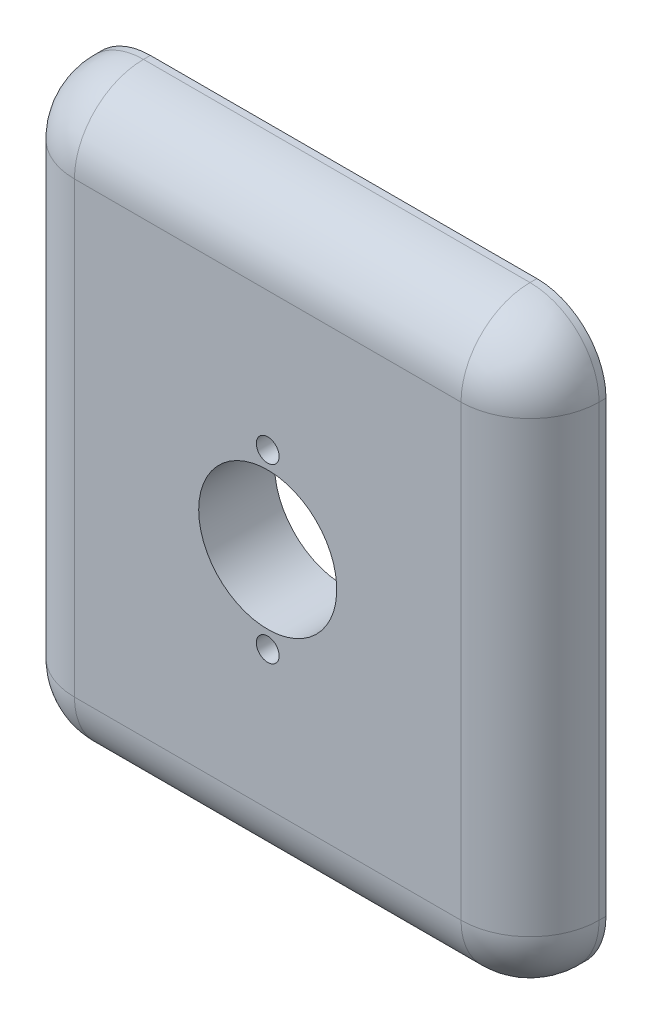
ISO-10303-21;
HEADER;
FILE_DESCRIPTION(('STEP AP214'),'2;1');
FILE_NAME('part.step','',(''),(''),'','','');
FILE_SCHEMA(('AUTOMOTIVE_DESIGN { 1 0 10303 214 1 1 1 1 }'));
ENDSEC;
DATA;
#1=APPLICATION_CONTEXT('core data for automotive mechanical design processes');
#2=APPLICATION_PROTOCOL_DEFINITION('international standard','automotive_design',2000,#1);
#3=PRODUCT_CONTEXT('',#1,'mechanical');
#4=PRODUCT('Part','Part','',(#3));
#5=PRODUCT_RELATED_PRODUCT_CATEGORY('part','',(#4));
#6=PRODUCT_DEFINITION_FORMATION('','',#4);
#7=PRODUCT_DEFINITION_CONTEXT('part definition',#1,'design');
#8=PRODUCT_DEFINITION('design','',#6,#7);
#9=PRODUCT_DEFINITION_SHAPE('','',#8);
#10=(LENGTH_UNIT() NAMED_UNIT(*) SI_UNIT(.MILLI.,.METRE.));
#11=(NAMED_UNIT(*) PLANE_ANGLE_UNIT() SI_UNIT($,.RADIAN.));
#12=(NAMED_UNIT(*) SI_UNIT($,.STERADIAN.) SOLID_ANGLE_UNIT());
#13=UNCERTAINTY_MEASURE_WITH_UNIT(LENGTH_MEASURE(1.E-05),#10,'distance_accuracy_value','');
#14=(GEOMETRIC_REPRESENTATION_CONTEXT(3) GLOBAL_UNCERTAINTY_ASSIGNED_CONTEXT((#13)) GLOBAL_UNIT_ASSIGNED_CONTEXT((#10,
#11,#12)) REPRESENTATION_CONTEXT('',''));
#15=CARTESIAN_POINT('',(0.,0.,0.));
#16=DIRECTION('',(0.,0.,1.));
#17=DIRECTION('',(1.,0.,0.));
#18=AXIS2_PLACEMENT_3D('',#15,#16,#17);
#19=CARTESIAN_POINT('',(0.,0.,0.));
#20=DIRECTION('',(0.,0.,-1.));
#21=DIRECTION('',(-1.,0.,0.));
#22=AXIS2_PLACEMENT_3D('',#19,#20,#21);
#23=PLANE('',#22);
#24=CARTESIAN_POINT('',(0.,-12.5,0.));
#25=DIRECTION('',(0.,0.,-1.));
#26=DIRECTION('',(1.,0.,0.));
#27=AXIS2_PLACEMENT_3D('',#24,#25,#26);
#28=CIRCLE('',#27,1.65);
#29=CARTESIAN_POINT('',(1.65,-12.5,0.));
#30=VERTEX_POINT('',#29);
#31=EDGE_CURVE('E398',#30,#30,#28,.T.);
#32=ORIENTED_EDGE('',*,*,#31,.F.);
#33=EDGE_LOOP('',(#32));
#34=FACE_BOUND('',#33,.T.);
#35=CARTESIAN_POINT('',(0.,12.5,0.));
#36=DIRECTION('',(0.,0.,-1.));
#37=DIRECTION('',(-1.,0.,0.));
#38=AXIS2_PLACEMENT_3D('',#35,#36,#37);
#39=CIRCLE('',#38,1.65);
#40=CARTESIAN_POINT('',(-1.65,12.5,0.));
#41=VERTEX_POINT('',#40);
#42=EDGE_CURVE('E402',#41,#41,#39,.T.);
#43=ORIENTED_EDGE('',*,*,#42,.F.);
#44=EDGE_LOOP('',(#43));
#45=FACE_BOUND('',#44,.T.);
#46=CARTESIAN_POINT('',(0.,0.,0.));
#47=DIRECTION('',(0.,0.,-1.));
#48=DIRECTION('',(-1.,0.,0.));
#49=AXIS2_PLACEMENT_3D('',#46,#47,#48);
#50=CIRCLE('',#49,10.);
#51=CARTESIAN_POINT('',(-10.,0.,0.));
#52=VERTEX_POINT('',#51);
#53=EDGE_CURVE('E394',#52,#52,#50,.T.);
#54=ORIENTED_EDGE('',*,*,#53,.F.);
#55=EDGE_LOOP('',(#54));
#56=FACE_BOUND('',#55,.T.);
#57=CARTESIAN_POINT('',(-28.,-28.,0.));
#58=DIRECTION('',(0.,0.,-1.));
#59=DIRECTION('',(-1.,0.,0.));
#60=AXIS2_PLACEMENT_3D('',#57,#58,#59);
#61=CIRCLE('',#60,3.);
#62=CARTESIAN_POINT('',(-31.,-28.,0.));
#63=VERTEX_POINT('',#62);
#64=EDGE_CURVE('E241',#63,#63,#61,.T.);
#65=ORIENTED_EDGE('',*,*,#64,.F.);
#66=EDGE_LOOP('',(#65));
#67=FACE_BOUND('',#66,.T.);
#68=CARTESIAN_POINT('',(28.,28.,0.));
#69=DIRECTION('',(0.,0.,-1.));
#70=DIRECTION('',(-1.,0.,0.));
#71=AXIS2_PLACEMENT_3D('',#68,#69,#70);
#72=CIRCLE('',#71,3.);
#73=CARTESIAN_POINT('',(25.,28.,0.));
#74=VERTEX_POINT('',#73);
#75=EDGE_CURVE('E233',#74,#74,#72,.T.);
#76=ORIENTED_EDGE('',*,*,#75,.F.);
#77=EDGE_LOOP('',(#76));
#78=FACE_BOUND('',#77,.T.);
#79=CARTESIAN_POINT('',(28.,-28.,0.));
#80=DIRECTION('',(0.,0.,-1.));
#81=DIRECTION('',(-1.,0.,0.));
#82=AXIS2_PLACEMENT_3D('',#79,#80,#81);
#83=CIRCLE('',#82,3.);
#84=CARTESIAN_POINT('',(25.,-28.,0.));
#85=VERTEX_POINT('',#84);
#86=EDGE_CURVE('E223',#85,#85,#83,.T.);
#87=ORIENTED_EDGE('',*,*,#86,.F.);
#88=EDGE_LOOP('',(#87));
#89=FACE_BOUND('',#88,.T.);
#90=CARTESIAN_POINT('',(-28.,28.,0.));
#91=DIRECTION('',(0.,0.,-1.));
#92=DIRECTION('',(-1.,0.,0.));
#93=AXIS2_PLACEMENT_3D('',#90,#91,#92);
#94=CIRCLE('',#93,3.);
#95=CARTESIAN_POINT('',(-31.,28.,0.));
#96=VERTEX_POINT('',#95);
#97=EDGE_CURVE('E240',#96,#96,#94,.T.);
#98=ORIENTED_EDGE('',*,*,#97,.F.);
#99=EDGE_LOOP('',(#98));
#100=FACE_BOUND('',#99,.T.);
#101=DIRECTION('',(1.,0.,0.));
#102=VECTOR('',#101,1.);
#103=CARTESIAN_POINT('',(38.,-42.5,0.));
#104=LINE('',#103,#102);
#105=CARTESIAN_POINT('',(-28.,-42.5,0.));
#106=VERTEX_POINT('',#105);
#107=CARTESIAN_POINT('',(28.,-42.5,0.));
#108=VERTEX_POINT('',#107);
#109=EDGE_CURVE('E129',#106,#108,#104,.T.);
#110=ORIENTED_EDGE('',*,*,#109,.F.);
#111=CARTESIAN_POINT('',(-28.,-32.5,0.));
#112=DIRECTION('',(0.,0.,-1.));
#113=DIRECTION('',(-1.,0.,0.));
#114=AXIS2_PLACEMENT_3D('',#111,#112,#113);
#115=CIRCLE('',#114,10.);
#116=CARTESIAN_POINT('',(-38.,-32.5,0.));
#117=VERTEX_POINT('',#116);
#118=EDGE_CURVE('E113',#106,#117,#115,.T.);
#119=ORIENTED_EDGE('',*,*,#118,.T.);
#120=DIRECTION('',(0.,-1.,0.));
#121=VECTOR('',#120,1.);
#122=CARTESIAN_POINT('',(-38.,42.5,0.));
#123=LINE('',#122,#121);
#124=CARTESIAN_POINT('',(-38.,32.5,0.));
#125=VERTEX_POINT('',#124);
#126=EDGE_CURVE('E139',#125,#117,#123,.T.);
#127=ORIENTED_EDGE('',*,*,#126,.F.);
#128=CARTESIAN_POINT('',(-28.,32.5,0.));
#129=DIRECTION('',(0.,0.,-1.));
#130=DIRECTION('',(-1.,0.,0.));
#131=AXIS2_PLACEMENT_3D('',#128,#129,#130);
#132=CIRCLE('',#131,10.);
#133=CARTESIAN_POINT('',(-28.,42.5,0.));
#134=VERTEX_POINT('',#133);
#135=EDGE_CURVE('E133',#125,#134,#132,.T.);
#136=ORIENTED_EDGE('',*,*,#135,.T.);
#137=DIRECTION('',(-1.,0.,0.));
#138=VECTOR('',#137,1.);
#139=CARTESIAN_POINT('',(38.,42.5,0.));
#140=LINE('',#139,#138);
#141=CARTESIAN_POINT('',(28.,42.5,0.));
#142=VERTEX_POINT('',#141);
#143=EDGE_CURVE('E142',#142,#134,#140,.T.);
#144=ORIENTED_EDGE('',*,*,#143,.F.);
#145=CARTESIAN_POINT('',(28.,32.5,0.));
#146=DIRECTION('',(0.,0.,-1.));
#147=DIRECTION('',(-1.,0.,0.));
#148=AXIS2_PLACEMENT_3D('',#145,#146,#147);
#149=CIRCLE('',#148,10.);
#150=CARTESIAN_POINT('',(38.,32.5,0.));
#151=VERTEX_POINT('',#150);
#152=EDGE_CURVE('E167',#142,#151,#149,.T.);
#153=ORIENTED_EDGE('',*,*,#152,.T.);
#154=DIRECTION('',(0.,1.,0.));
#155=VECTOR('',#154,1.);
#156=CARTESIAN_POINT('',(38.,42.5,0.));
#157=LINE('',#156,#155);
#158=CARTESIAN_POINT('',(38.,-32.5,0.));
#159=VERTEX_POINT('',#158);
#160=EDGE_CURVE('E138',#159,#151,#157,.T.);
#161=ORIENTED_EDGE('',*,*,#160,.F.);
#162=CARTESIAN_POINT('',(28.,-32.5,0.));
#163=DIRECTION('',(0.,0.,-1.));
#164=DIRECTION('',(-1.,0.,0.));
#165=AXIS2_PLACEMENT_3D('',#162,#163,#164);
#166=CIRCLE('',#165,10.);
#167=EDGE_CURVE('E124',#159,#108,#166,.T.);
#168=ORIENTED_EDGE('',*,*,#167,.T.);
#169=EDGE_LOOP('',(#110,#119,#127,#136,#144,#153,#161,#168));
#170=FACE_BOUND('',#169,.T.);
#171=ADVANCED_FACE('F33',(#34,#45,#56,#67,#78,#89,#100,#170),#23,.T.);
#172=CARTESIAN_POINT('',(-38.,42.5,11.));
#173=DIRECTION('',(1.,0.,0.));
#174=DIRECTION('',(0.,1.,0.));
#175=AXIS2_PLACEMENT_3D('',#172,#173,#174);
#176=PLANE('',#175);
#177=ORIENTED_EDGE('',*,*,#126,.T.);
#178=DIRECTION('',(0.,0.,-1.));
#179=VECTOR('',#178,1.);
#180=CARTESIAN_POINT('',(-38.,-32.5,11.));
#181=LINE('',#180,#179);
#182=CARTESIAN_POINT('',(-38.,-32.5,0.999999999999999));
#183=VERTEX_POINT('',#182);
#184=EDGE_CURVE('E118',#117,#183,#181,.F.);
#185=ORIENTED_EDGE('',*,*,#184,.T.);
#186=DIRECTION('',(0.,-1.,0.));
#187=VECTOR('',#186,1.);
#188=CARTESIAN_POINT('',(-38.,42.5,0.999999999999999));
#189=LINE('',#188,#187);
#190=CARTESIAN_POINT('',(-38.,32.5,0.999999999999999));
#191=VERTEX_POINT('',#190);
#192=EDGE_CURVE('E123',#183,#191,#189,.F.);
#193=ORIENTED_EDGE('',*,*,#192,.T.);
#194=DIRECTION('',(0.,0.,-1.));
#195=VECTOR('',#194,1.);
#196=CARTESIAN_POINT('',(-38.,32.5,11.));
#197=LINE('',#196,#195);
#198=EDGE_CURVE('E171',#191,#125,#197,.T.);
#199=ORIENTED_EDGE('',*,*,#198,.T.);
#200=EDGE_LOOP('',(#177,#185,#193,#199));
#201=FACE_BOUND('',#200,.T.);
#202=ADVANCED_FACE('F289',(#201),#176,.F.);
#203=CARTESIAN_POINT('',(38.,-42.5,11.));
#204=DIRECTION('',(0.,1.,0.));
#205=DIRECTION('',(-1.,0.,0.));
#206=AXIS2_PLACEMENT_3D('',#203,#204,#205);
#207=PLANE('',#206);
#208=DIRECTION('',(1.,0.,0.));
#209=VECTOR('',#208,1.);
#210=CARTESIAN_POINT('',(38.,-42.5,0.999999999999999));
#211=LINE('',#210,#209);
#212=CARTESIAN_POINT('',(28.,-42.5,0.999999999999999));
#213=VERTEX_POINT('',#212);
#214=CARTESIAN_POINT('',(-28.,-42.5,0.999999999999999));
#215=VERTEX_POINT('',#214);
#216=EDGE_CURVE('E131',#213,#215,#211,.F.);
#217=ORIENTED_EDGE('',*,*,#216,.T.);
#218=DIRECTION('',(0.,0.,-1.));
#219=VECTOR('',#218,1.);
#220=CARTESIAN_POINT('',(-28.,-42.5,11.));
#221=LINE('',#220,#219);
#222=EDGE_CURVE('E117',#215,#106,#221,.T.);
#223=ORIENTED_EDGE('',*,*,#222,.T.);
#224=ORIENTED_EDGE('',*,*,#109,.T.);
#225=DIRECTION('',(0.,0.,-1.));
#226=VECTOR('',#225,1.);
#227=CARTESIAN_POINT('',(28.,-42.5,11.));
#228=LINE('',#227,#226);
#229=EDGE_CURVE('E134',#108,#213,#228,.F.);
#230=ORIENTED_EDGE('',*,*,#229,.T.);
#231=EDGE_LOOP('',(#217,#223,#224,#230));
#232=FACE_BOUND('',#231,.T.);
#233=ADVANCED_FACE('F128',(#232),#207,.F.);
#234=CARTESIAN_POINT('',(38.,42.5,11.));
#235=DIRECTION('',(-1.,0.,0.));
#236=DIRECTION('',(0.,-1.,0.));
#237=AXIS2_PLACEMENT_3D('',#234,#235,#236);
#238=PLANE('',#237);
#239=DIRECTION('',(0.,1.,0.));
#240=VECTOR('',#239,1.);
#241=CARTESIAN_POINT('',(38.,42.5,0.999999999999999));
#242=LINE('',#241,#240);
#243=CARTESIAN_POINT('',(38.,32.5,0.999999999999999));
#244=VERTEX_POINT('',#243);
#245=CARTESIAN_POINT('',(38.,-32.5,0.999999999999999));
#246=VERTEX_POINT('',#245);
#247=EDGE_CURVE('E174',#244,#246,#242,.F.);
#248=ORIENTED_EDGE('',*,*,#247,.T.);
#249=DIRECTION('',(0.,0.,-1.));
#250=VECTOR('',#249,1.);
#251=CARTESIAN_POINT('',(38.,-32.5,11.));
#252=LINE('',#251,#250);
#253=EDGE_CURVE('E178',#246,#159,#252,.T.);
#254=ORIENTED_EDGE('',*,*,#253,.T.);
#255=ORIENTED_EDGE('',*,*,#160,.T.);
#256=DIRECTION('',(0.,0.,-1.));
#257=VECTOR('',#256,1.);
#258=CARTESIAN_POINT('',(38.,32.5,11.));
#259=LINE('',#258,#257);
#260=EDGE_CURVE('E176',#151,#244,#259,.F.);
#261=ORIENTED_EDGE('',*,*,#260,.T.);
#262=EDGE_LOOP('',(#248,#254,#255,#261));
#263=FACE_BOUND('',#262,.T.);
#264=ADVANCED_FACE('F307',(#263),#238,.F.);
#265=CARTESIAN_POINT('',(38.,42.5,11.));
#266=DIRECTION('',(0.,-1.,0.));
#267=DIRECTION('',(1.,0.,0.));
#268=AXIS2_PLACEMENT_3D('',#265,#266,#267);
#269=PLANE('',#268);
#270=DIRECTION('',(-1.,0.,0.));
#271=VECTOR('',#270,1.);
#272=CARTESIAN_POINT('',(38.,42.5,0.999999999999999));
#273=LINE('',#272,#271);
#274=CARTESIAN_POINT('',(-28.,42.5,0.999999999999999));
#275=VERTEX_POINT('',#274);
#276=CARTESIAN_POINT('',(28.,42.5,0.999999999999999));
#277=VERTEX_POINT('',#276);
#278=EDGE_CURVE('E180',#275,#277,#273,.F.);
#279=ORIENTED_EDGE('',*,*,#278,.T.);
#280=DIRECTION('',(0.,0.,-1.));
#281=VECTOR('',#280,1.);
#282=CARTESIAN_POINT('',(28.,42.5,11.));
#283=LINE('',#282,#281);
#284=EDGE_CURVE('E184',#277,#142,#283,.T.);
#285=ORIENTED_EDGE('',*,*,#284,.T.);
#286=ORIENTED_EDGE('',*,*,#143,.T.);
#287=DIRECTION('',(0.,0.,-1.));
#288=VECTOR('',#287,1.);
#289=CARTESIAN_POINT('',(-28.,42.5,11.));
#290=LINE('',#289,#288);
#291=EDGE_CURVE('E182',#134,#275,#290,.F.);
#292=ORIENTED_EDGE('',*,*,#291,.T.);
#293=EDGE_LOOP('',(#279,#285,#286,#292));
#294=FACE_BOUND('',#293,.T.);
#295=ADVANCED_FACE('F304',(#294),#269,.F.);
#296=CARTESIAN_POINT('',(0.,0.,11.));
#297=DIRECTION('',(0.,0.,-1.));
#298=DIRECTION('',(-1.,0.,0.));
#299=AXIS2_PLACEMENT_3D('',#296,#297,#298);
#300=PLANE('',#299);
#301=CARTESIAN_POINT('',(0.,-12.5,11.));
#302=DIRECTION('',(0.,0.,-1.));
#303=DIRECTION('',(1.,0.,0.));
#304=AXIS2_PLACEMENT_3D('',#301,#302,#303);
#305=CIRCLE('',#304,1.65);
#306=CARTESIAN_POINT('',(1.65,-12.5,11.));
#307=VERTEX_POINT('',#306);
#308=EDGE_CURVE('E386',#307,#307,#305,.T.);
#309=ORIENTED_EDGE('',*,*,#308,.T.);
#310=EDGE_LOOP('',(#309));
#311=FACE_BOUND('',#310,.T.);
#312=CARTESIAN_POINT('',(0.,12.5,11.));
#313=DIRECTION('',(0.,0.,-1.));
#314=DIRECTION('',(-1.,0.,0.));
#315=AXIS2_PLACEMENT_3D('',#312,#313,#314);
#316=CIRCLE('',#315,1.65);
#317=CARTESIAN_POINT('',(-1.65,12.5,11.));
#318=VERTEX_POINT('',#317);
#319=EDGE_CURVE('E390',#318,#318,#316,.T.);
#320=ORIENTED_EDGE('',*,*,#319,.T.);
#321=EDGE_LOOP('',(#320));
#322=FACE_BOUND('',#321,.T.);
#323=CARTESIAN_POINT('',(0.,0.,11.));
#324=DIRECTION('',(0.,0.,-1.));
#325=DIRECTION('',(-1.,0.,0.));
#326=AXIS2_PLACEMENT_3D('',#323,#324,#325);
#327=CIRCLE('',#326,10.);
#328=CARTESIAN_POINT('',(-10.,0.,11.));
#329=VERTEX_POINT('',#328);
#330=EDGE_CURVE('E194',#329,#329,#327,.T.);
#331=ORIENTED_EDGE('',*,*,#330,.T.);
#332=EDGE_LOOP('',(#331));
#333=FACE_BOUND('',#332,.T.);
#334=DIRECTION('',(0.,-1.,0.));
#335=VECTOR('',#334,1.);
#336=CARTESIAN_POINT('',(-28.,0.,11.));
#337=LINE('',#336,#335);
#338=CARTESIAN_POINT('',(-28.,32.5,11.));
#339=VERTEX_POINT('',#338);
#340=CARTESIAN_POINT('',(-28.,-32.5,11.));
#341=VERTEX_POINT('',#340);
#342=EDGE_CURVE('E186',#339,#341,#337,.T.);
#343=ORIENTED_EDGE('',*,*,#342,.T.);
#344=DIRECTION('',(1.,0.,0.));
#345=VECTOR('',#344,1.);
#346=CARTESIAN_POINT('',(0.,-32.5,11.));
#347=LINE('',#346,#345);
#348=CARTESIAN_POINT('',(28.,-32.5,11.));
#349=VERTEX_POINT('',#348);
#350=EDGE_CURVE('E11',#341,#349,#347,.T.);
#351=ORIENTED_EDGE('',*,*,#350,.T.);
#352=DIRECTION('',(0.,1.,0.));
#353=VECTOR('',#352,1.);
#354=CARTESIAN_POINT('',(28.,0.,11.));
#355=LINE('',#354,#353);
#356=CARTESIAN_POINT('',(28.,32.5,11.));
#357=VERTEX_POINT('',#356);
#358=EDGE_CURVE('E42',#349,#357,#355,.T.);
#359=ORIENTED_EDGE('',*,*,#358,.T.);
#360=DIRECTION('',(-1.,0.,0.));
#361=VECTOR('',#360,1.);
#362=CARTESIAN_POINT('',(0.,32.5,11.));
#363=LINE('',#362,#361);
#364=EDGE_CURVE('E188',#357,#339,#363,.T.);
#365=ORIENTED_EDGE('',*,*,#364,.T.);
#366=EDGE_LOOP('',(#343,#351,#359,#365));
#367=FACE_BOUND('',#366,.T.);
#368=ADVANCED_FACE('F303',(#311,#322,#333,#367),#300,.F.);
#369=CARTESIAN_POINT('',(-28.,28.,2.));
#370=DIRECTION('',(0.,0.,-1.));
#371=DIRECTION('',(-1.,0.,0.));
#372=AXIS2_PLACEMENT_3D('',#369,#370,#371);
#373=CYLINDRICAL_SURFACE('',#372,3.);
#374=CARTESIAN_POINT('',(-28.,28.,2.));
#375=DIRECTION('',(0.,0.,-1.));
#376=DIRECTION('',(-1.,0.,0.));
#377=AXIS2_PLACEMENT_3D('',#374,#375,#376);
#378=CIRCLE('',#377,3.);
#379=CARTESIAN_POINT('',(-31.,28.,2.));
#380=VERTEX_POINT('',#379);
#381=EDGE_CURVE('E154',#380,#380,#378,.T.);
#382=ORIENTED_EDGE('',*,*,#381,.F.);
#383=EDGE_LOOP('',(#382));
#384=FACE_BOUND('',#383,.T.);
#385=ORIENTED_EDGE('',*,*,#97,.T.);
#386=EDGE_LOOP('',(#385));
#387=FACE_BOUND('',#386,.T.);
#388=ADVANCED_FACE('F374',(#384,#387),#373,.F.);
#389=CARTESIAN_POINT('',(-28.,28.,2.));
#390=DIRECTION('',(0.,0.,-1.));
#391=DIRECTION('',(-1.,0.,0.));
#392=AXIS2_PLACEMENT_3D('',#389,#390,#391);
#393=PLANE('',#392);
#394=CARTESIAN_POINT('',(-28.,28.,2.));
#395=DIRECTION('',(0.,0.,-1.));
#396=DIRECTION('',(-1.,0.,0.));
#397=AXIS2_PLACEMENT_3D('',#394,#395,#396);
#398=CIRCLE('',#397,1.65);
#399=CARTESIAN_POINT('',(-29.65,28.,2.));
#400=VERTEX_POINT('',#399);
#401=EDGE_CURVE('E150',#400,#400,#398,.T.);
#402=ORIENTED_EDGE('',*,*,#401,.F.);
#403=EDGE_LOOP('',(#402));
#404=FACE_BOUND('',#403,.T.);
#405=ORIENTED_EDGE('',*,*,#381,.T.);
#406=EDGE_LOOP('',(#405));
#407=FACE_BOUND('',#406,.T.);
#408=ADVANCED_FACE('F380',(#404,#407),#393,.T.);
#409=CARTESIAN_POINT('',(28.,28.,2.));
#410=DIRECTION('',(0.,0.,-1.));
#411=DIRECTION('',(-1.,0.,0.));
#412=AXIS2_PLACEMENT_3D('',#409,#410,#411);
#413=PLANE('',#412);
#414=CARTESIAN_POINT('',(28.,28.,2.));
#415=DIRECTION('',(0.,0.,-1.));
#416=DIRECTION('',(-1.,0.,0.));
#417=AXIS2_PLACEMENT_3D('',#414,#415,#416);
#418=CIRCLE('',#417,3.);
#419=CARTESIAN_POINT('',(25.,28.,2.));
#420=VERTEX_POINT('',#419);
#421=EDGE_CURVE('E244',#420,#420,#418,.T.);
#422=ORIENTED_EDGE('',*,*,#421,.T.);
#423=EDGE_LOOP('',(#422));
#424=FACE_BOUND('',#423,.T.);
#425=CARTESIAN_POINT('',(28.,28.,2.));
#426=DIRECTION('',(0.,0.,-1.));
#427=DIRECTION('',(-1.,0.,0.));
#428=AXIS2_PLACEMENT_3D('',#425,#426,#427);
#429=CIRCLE('',#428,1.65);
#430=CARTESIAN_POINT('',(26.35,28.,2.));
#431=VERTEX_POINT('',#430);
#432=EDGE_CURVE('E153',#431,#431,#429,.F.);
#433=ORIENTED_EDGE('',*,*,#432,.T.);
#434=EDGE_LOOP('',(#433));
#435=FACE_BOUND('',#434,.T.);
#436=ADVANCED_FACE('F421',(#424,#435),#413,.T.);
#437=CARTESIAN_POINT('',(28.,28.,2.));
#438=DIRECTION('',(0.,0.,-1.));
#439=DIRECTION('',(-1.,0.,0.));
#440=AXIS2_PLACEMENT_3D('',#437,#438,#439);
#441=CYLINDRICAL_SURFACE('',#440,3.);
#442=ORIENTED_EDGE('',*,*,#421,.F.);
#443=EDGE_LOOP('',(#442));
#444=FACE_BOUND('',#443,.T.);
#445=ORIENTED_EDGE('',*,*,#75,.T.);
#446=EDGE_LOOP('',(#445));
#447=FACE_BOUND('',#446,.T.);
#448=ADVANCED_FACE('F419',(#444,#447),#441,.F.);
#449=CARTESIAN_POINT('',(28.,-28.,2.));
#450=DIRECTION('',(0.,0.,-1.));
#451=DIRECTION('',(-1.,0.,0.));
#452=AXIS2_PLACEMENT_3D('',#449,#450,#451);
#453=CYLINDRICAL_SURFACE('',#452,3.);
#454=CARTESIAN_POINT('',(28.,-28.,2.));
#455=DIRECTION('',(0.,0.,-1.));
#456=DIRECTION('',(-1.,0.,0.));
#457=AXIS2_PLACEMENT_3D('',#454,#455,#456);
#458=CIRCLE('',#457,3.);
#459=CARTESIAN_POINT('',(25.,-28.,2.));
#460=VERTEX_POINT('',#459);
#461=EDGE_CURVE('E228',#460,#460,#458,.T.);
#462=ORIENTED_EDGE('',*,*,#461,.F.);
#463=EDGE_LOOP('',(#462));
#464=FACE_BOUND('',#463,.T.);
#465=ORIENTED_EDGE('',*,*,#86,.T.);
#466=EDGE_LOOP('',(#465));
#467=FACE_BOUND('',#466,.T.);
#468=ADVANCED_FACE('F284',(#464,#467),#453,.F.);
#469=CARTESIAN_POINT('',(28.,-28.,2.));
#470=DIRECTION('',(0.,0.,-1.));
#471=DIRECTION('',(-1.,0.,0.));
#472=AXIS2_PLACEMENT_3D('',#469,#470,#471);
#473=PLANE('',#472);
#474=CARTESIAN_POINT('',(28.,-28.,2.));
#475=DIRECTION('',(0.,0.,-1.));
#476=DIRECTION('',(-1.,0.,0.));
#477=AXIS2_PLACEMENT_3D('',#474,#475,#476);
#478=CIRCLE('',#477,1.65);
#479=CARTESIAN_POINT('',(26.35,-28.,2.));
#480=VERTEX_POINT('',#479);
#481=EDGE_CURVE('E157',#480,#480,#478,.T.);
#482=ORIENTED_EDGE('',*,*,#481,.F.);
#483=EDGE_LOOP('',(#482));
#484=FACE_BOUND('',#483,.T.);
#485=ORIENTED_EDGE('',*,*,#461,.T.);
#486=EDGE_LOOP('',(#485));
#487=FACE_BOUND('',#486,.T.);
#488=ADVANCED_FACE('F274',(#484,#487),#473,.T.);
#489=CARTESIAN_POINT('',(-28.,-28.,2.));
#490=DIRECTION('',(0.,0.,-1.));
#491=DIRECTION('',(-1.,0.,0.));
#492=AXIS2_PLACEMENT_3D('',#489,#490,#491);
#493=PLANE('',#492);
#494=CARTESIAN_POINT('',(-28.,-28.,2.));
#495=DIRECTION('',(0.,0.,-1.));
#496=DIRECTION('',(-1.,0.,0.));
#497=AXIS2_PLACEMENT_3D('',#494,#495,#496);
#498=CIRCLE('',#497,3.);
#499=CARTESIAN_POINT('',(-31.,-28.,2.));
#500=VERTEX_POINT('',#499);
#501=EDGE_CURVE('E237',#500,#500,#498,.T.);
#502=ORIENTED_EDGE('',*,*,#501,.T.);
#503=EDGE_LOOP('',(#502));
#504=FACE_BOUND('',#503,.T.);
#505=CARTESIAN_POINT('',(-28.,-28.,2.));
#506=DIRECTION('',(0.,0.,-1.));
#507=DIRECTION('',(-1.,0.,0.));
#508=AXIS2_PLACEMENT_3D('',#505,#506,#507);
#509=CIRCLE('',#508,1.65);
#510=CARTESIAN_POINT('',(-29.65,-28.,2.));
#511=VERTEX_POINT('',#510);
#512=EDGE_CURVE('E160',#511,#511,#509,.F.);
#513=ORIENTED_EDGE('',*,*,#512,.T.);
#514=EDGE_LOOP('',(#513));
#515=FACE_BOUND('',#514,.T.);
#516=ADVANCED_FACE('F271',(#504,#515),#493,.T.);
#517=CARTESIAN_POINT('',(-28.,-28.,2.));
#518=DIRECTION('',(0.,0.,-1.));
#519=DIRECTION('',(-1.,0.,0.));
#520=AXIS2_PLACEMENT_3D('',#517,#518,#519);
#521=CYLINDRICAL_SURFACE('',#520,3.);
#522=ORIENTED_EDGE('',*,*,#501,.F.);
#523=EDGE_LOOP('',(#522));
#524=FACE_BOUND('',#523,.T.);
#525=ORIENTED_EDGE('',*,*,#64,.T.);
#526=EDGE_LOOP('',(#525));
#527=FACE_BOUND('',#526,.T.);
#528=ADVANCED_FACE('F273',(#524,#527),#521,.F.);
#529=CARTESIAN_POINT('',(-28.,28.,5.));
#530=DIRECTION('',(0.,0.,1.));
#531=DIRECTION('',(1.,0.,0.));
#532=AXIS2_PLACEMENT_3D('',#529,#530,#531);
#533=PLANE('',#532);
#534=CARTESIAN_POINT('',(-28.,28.,5.));
#535=DIRECTION('',(0.,0.,1.));
#536=DIRECTION('',(1.,0.,0.));
#537=AXIS2_PLACEMENT_3D('',#534,#535,#536);
#538=CIRCLE('',#537,1.65);
#539=CARTESIAN_POINT('',(-26.35,28.,5.));
#540=VERTEX_POINT('',#539);
#541=EDGE_CURVE('E163',#540,#540,#538,.T.);
#542=ORIENTED_EDGE('',*,*,#541,.F.);
#543=EDGE_LOOP('',(#542));
#544=FACE_BOUND('',#543,.T.);
#545=ADVANCED_FACE('F281',(#544),#533,.F.);
#546=CARTESIAN_POINT('',(-28.,28.,5.));
#547=DIRECTION('',(0.,0.,-1.));
#548=DIRECTION('',(-1.,0.,0.));
#549=AXIS2_PLACEMENT_3D('',#546,#547,#548);
#550=CYLINDRICAL_SURFACE('',#549,1.65);
#551=ORIENTED_EDGE('',*,*,#541,.T.);
#552=EDGE_LOOP('',(#551));
#553=FACE_BOUND('',#552,.T.);
#554=ORIENTED_EDGE('',*,*,#401,.T.);
#555=EDGE_LOOP('',(#554));
#556=FACE_BOUND('',#555,.T.);
#557=ADVANCED_FACE('F451',(#553,#556),#550,.F.);
#558=CARTESIAN_POINT('',(28.,28.,5.));
#559=DIRECTION('',(0.,0.,-1.));
#560=DIRECTION('',(-1.,0.,0.));
#561=AXIS2_PLACEMENT_3D('',#558,#559,#560);
#562=PLANE('',#561);
#563=CARTESIAN_POINT('',(28.,28.,5.));
#564=DIRECTION('',(0.,0.,-1.));
#565=DIRECTION('',(-1.,0.,0.));
#566=AXIS2_PLACEMENT_3D('',#563,#564,#565);
#567=CIRCLE('',#566,1.65);
#568=CARTESIAN_POINT('',(26.35,28.,5.));
#569=VERTEX_POINT('',#568);
#570=EDGE_CURVE('E256',#569,#569,#567,.T.);
#571=ORIENTED_EDGE('',*,*,#570,.T.);
#572=EDGE_LOOP('',(#571));
#573=FACE_BOUND('',#572,.T.);
#574=ADVANCED_FACE('F447',(#573),#562,.T.);
#575=CARTESIAN_POINT('',(28.,28.,5.));
#576=DIRECTION('',(0.,0.,-1.));
#577=DIRECTION('',(-1.,0.,0.));
#578=AXIS2_PLACEMENT_3D('',#575,#576,#577);
#579=CYLINDRICAL_SURFACE('',#578,1.65);
#580=ORIENTED_EDGE('',*,*,#570,.F.);
#581=EDGE_LOOP('',(#580));
#582=FACE_BOUND('',#581,.T.);
#583=ORIENTED_EDGE('',*,*,#432,.F.);
#584=EDGE_LOOP('',(#583));
#585=FACE_BOUND('',#584,.T.);
#586=ADVANCED_FACE('F443',(#582,#585),#579,.F.);
#587=CARTESIAN_POINT('',(28.,-28.,5.));
#588=DIRECTION('',(0.,0.,1.));
#589=DIRECTION('',(1.,0.,0.));
#590=AXIS2_PLACEMENT_3D('',#587,#588,#589);
#591=PLANE('',#590);
#592=CARTESIAN_POINT('',(28.,-28.,5.));
#593=DIRECTION('',(0.,0.,1.));
#594=DIRECTION('',(1.,0.,0.));
#595=AXIS2_PLACEMENT_3D('',#592,#593,#594);
#596=CIRCLE('',#595,1.65);
#597=CARTESIAN_POINT('',(29.65,-28.,5.));
#598=VERTEX_POINT('',#597);
#599=EDGE_CURVE('E253',#598,#598,#596,.T.);
#600=ORIENTED_EDGE('',*,*,#599,.F.);
#601=EDGE_LOOP('',(#600));
#602=FACE_BOUND('',#601,.T.);
#603=ADVANCED_FACE('F439',(#602),#591,.F.);
#604=CARTESIAN_POINT('',(28.,-28.,5.));
#605=DIRECTION('',(0.,0.,-1.));
#606=DIRECTION('',(-1.,0.,0.));
#607=AXIS2_PLACEMENT_3D('',#604,#605,#606);
#608=CYLINDRICAL_SURFACE('',#607,1.65);
#609=ORIENTED_EDGE('',*,*,#599,.T.);
#610=EDGE_LOOP('',(#609));
#611=FACE_BOUND('',#610,.T.);
#612=ORIENTED_EDGE('',*,*,#481,.T.);
#613=EDGE_LOOP('',(#612));
#614=FACE_BOUND('',#613,.T.);
#615=ADVANCED_FACE('F436',(#611,#614),#608,.F.);
#616=CARTESIAN_POINT('',(-28.,-28.,5.));
#617=DIRECTION('',(0.,0.,-1.));
#618=DIRECTION('',(-1.,0.,0.));
#619=AXIS2_PLACEMENT_3D('',#616,#617,#618);
#620=PLANE('',#619);
#621=CARTESIAN_POINT('',(-28.,-28.,5.));
#622=DIRECTION('',(0.,0.,-1.));
#623=DIRECTION('',(-1.,0.,0.));
#624=AXIS2_PLACEMENT_3D('',#621,#622,#623);
#625=CIRCLE('',#624,1.65);
#626=CARTESIAN_POINT('',(-29.65,-28.,5.));
#627=VERTEX_POINT('',#626);
#628=EDGE_CURVE('E144',#627,#627,#625,.T.);
#629=ORIENTED_EDGE('',*,*,#628,.T.);
#630=EDGE_LOOP('',(#629));
#631=FACE_BOUND('',#630,.T.);
#632=ADVANCED_FACE('F263',(#631),#620,.T.);
#633=CARTESIAN_POINT('',(-28.,-28.,5.));
#634=DIRECTION('',(0.,0.,-1.));
#635=DIRECTION('',(-1.,0.,0.));
#636=AXIS2_PLACEMENT_3D('',#633,#634,#635);
#637=CYLINDRICAL_SURFACE('',#636,1.65);
#638=ORIENTED_EDGE('',*,*,#628,.F.);
#639=EDGE_LOOP('',(#638));
#640=FACE_BOUND('',#639,.T.);
#641=ORIENTED_EDGE('',*,*,#512,.F.);
#642=EDGE_LOOP('',(#641));
#643=FACE_BOUND('',#642,.T.);
#644=ADVANCED_FACE('F265',(#640,#643),#637,.F.);
#645=CARTESIAN_POINT('',(28.,32.5,11.));
#646=DIRECTION('',(0.,0.,-1.));
#647=DIRECTION('',(-1.,0.,0.));
#648=AXIS2_PLACEMENT_3D('',#645,#646,#647);
#649=CYLINDRICAL_SURFACE('',#648,10.);
#650=CARTESIAN_POINT('',(28.,32.5,0.999999999999999));
#651=DIRECTION('',(0.,0.,1.));
#652=DIRECTION('',(1.,0.,0.));
#653=AXIS2_PLACEMENT_3D('',#650,#651,#652);
#654=CIRCLE('',#653,10.);
#655=EDGE_CURVE('E37',#244,#277,#654,.T.);
#656=ORIENTED_EDGE('',*,*,#655,.F.);
#657=ORIENTED_EDGE('',*,*,#260,.F.);
#658=ORIENTED_EDGE('',*,*,#152,.F.);
#659=ORIENTED_EDGE('',*,*,#284,.F.);
#660=EDGE_LOOP('',(#656,#657,#658,#659));
#661=FACE_BOUND('',#660,.T.);
#662=ADVANCED_FACE('F35',(#661),#649,.T.);
#663=CARTESIAN_POINT('',(28.,32.5,0.999999999999999));
#664=DIRECTION('',(0.,0.,1.));
#665=DIRECTION('',(1.,0.,0.));
#666=AXIS2_PLACEMENT_3D('',#663,#664,#665);
#667=SPHERICAL_SURFACE('',#666,10.);
#668=CARTESIAN_POINT('',(28.,32.5,0.999999999999999));
#669=DIRECTION('',(0.,1.,0.));
#670=DIRECTION('',(0.,0.,1.));
#671=AXIS2_PLACEMENT_3D('',#668,#669,#670);
#672=CIRCLE('',#671,10.);
#673=EDGE_CURVE('E215',#244,#357,#672,.F.);
#674=ORIENTED_EDGE('',*,*,#673,.F.);
#675=ORIENTED_EDGE('',*,*,#655,.T.);
#676=CARTESIAN_POINT('',(28.,32.5,0.999999999999999));
#677=DIRECTION('',(1.,0.,0.));
#678=DIRECTION('',(0.,1.,0.));
#679=AXIS2_PLACEMENT_3D('',#676,#677,#678);
#680=CIRCLE('',#679,10.);
#681=EDGE_CURVE('E216',#357,#277,#680,.F.);
#682=ORIENTED_EDGE('',*,*,#681,.F.);
#683=EDGE_LOOP('',(#674,#675,#682));
#684=FACE_BOUND('',#683,.T.);
#685=ADVANCED_FACE('F349',(#684),#667,.T.);
#686=CARTESIAN_POINT('',(-28.,32.5,11.));
#687=DIRECTION('',(0.,0.,-1.));
#688=DIRECTION('',(-1.,0.,0.));
#689=AXIS2_PLACEMENT_3D('',#686,#687,#688);
#690=CYLINDRICAL_SURFACE('',#689,10.);
#691=ORIENTED_EDGE('',*,*,#135,.F.);
#692=ORIENTED_EDGE('',*,*,#198,.F.);
#693=CARTESIAN_POINT('',(-28.,32.5,0.999999999999999));
#694=DIRECTION('',(0.,0.,1.));
#695=DIRECTION('',(1.,0.,0.));
#696=AXIS2_PLACEMENT_3D('',#693,#694,#695);
#697=CIRCLE('',#696,10.);
#698=EDGE_CURVE('E212',#275,#191,#697,.T.);
#699=ORIENTED_EDGE('',*,*,#698,.F.);
#700=ORIENTED_EDGE('',*,*,#291,.F.);
#701=EDGE_LOOP('',(#691,#692,#699,#700));
#702=FACE_BOUND('',#701,.T.);
#703=ADVANCED_FACE('F347',(#702),#690,.T.);
#704=CARTESIAN_POINT('',(0.,32.5,0.999999999999999));
#705=DIRECTION('',(-1.,0.,0.));
#706=DIRECTION('',(0.,-1.,0.));
#707=AXIS2_PLACEMENT_3D('',#704,#705,#706);
#708=CYLINDRICAL_SURFACE('',#707,10.);
#709=ORIENTED_EDGE('',*,*,#681,.T.);
#710=ORIENTED_EDGE('',*,*,#278,.F.);
#711=CARTESIAN_POINT('',(-28.,32.5,0.999999999999999));
#712=DIRECTION('',(-1.,0.,0.));
#713=DIRECTION('',(0.,-1.,0.));
#714=AXIS2_PLACEMENT_3D('',#711,#712,#713);
#715=CIRCLE('',#714,10.);
#716=EDGE_CURVE('E209',#339,#275,#715,.T.);
#717=ORIENTED_EDGE('',*,*,#716,.F.);
#718=ORIENTED_EDGE('',*,*,#364,.F.);
#719=EDGE_LOOP('',(#709,#710,#717,#718));
#720=FACE_BOUND('',#719,.T.);
#721=ADVANCED_FACE('F343',(#720),#708,.T.);
#722=CARTESIAN_POINT('',(28.,0.,0.999999999999999));
#723=DIRECTION('',(0.,1.,0.));
#724=DIRECTION('',(-1.,0.,0.));
#725=AXIS2_PLACEMENT_3D('',#722,#723,#724);
#726=CYLINDRICAL_SURFACE('',#725,10.);
#727=ORIENTED_EDGE('',*,*,#673,.T.);
#728=ORIENTED_EDGE('',*,*,#358,.F.);
#729=CARTESIAN_POINT('',(28.,-32.5,0.999999999999999));
#730=DIRECTION('',(0.,-1.,0.));
#731=DIRECTION('',(0.,0.,-1.));
#732=AXIS2_PLACEMENT_3D('',#729,#730,#731);
#733=CIRCLE('',#732,10.);
#734=EDGE_CURVE('E207',#246,#349,#733,.T.);
#735=ORIENTED_EDGE('',*,*,#734,.F.);
#736=ORIENTED_EDGE('',*,*,#247,.F.);
#737=EDGE_LOOP('',(#727,#728,#735,#736));
#738=FACE_BOUND('',#737,.T.);
#739=ADVANCED_FACE('F339',(#738),#726,.T.);
#740=CARTESIAN_POINT('',(28.,-32.5,11.));
#741=DIRECTION('',(0.,0.,-1.));
#742=DIRECTION('',(-1.,0.,0.));
#743=AXIS2_PLACEMENT_3D('',#740,#741,#742);
#744=CYLINDRICAL_SURFACE('',#743,10.);
#745=ORIENTED_EDGE('',*,*,#167,.F.);
#746=ORIENTED_EDGE('',*,*,#253,.F.);
#747=CARTESIAN_POINT('',(28.,-32.5,0.999999999999999));
#748=DIRECTION('',(0.,0.,1.));
#749=DIRECTION('',(1.,0.,0.));
#750=AXIS2_PLACEMENT_3D('',#747,#748,#749);
#751=CIRCLE('',#750,10.);
#752=EDGE_CURVE('E204',#213,#246,#751,.T.);
#753=ORIENTED_EDGE('',*,*,#752,.F.);
#754=ORIENTED_EDGE('',*,*,#229,.F.);
#755=EDGE_LOOP('',(#745,#746,#753,#754));
#756=FACE_BOUND('',#755,.T.);
#757=ADVANCED_FACE('F335',(#756),#744,.T.);
#758=CARTESIAN_POINT('',(-28.,32.5,0.999999999999999));
#759=DIRECTION('',(0.,0.,1.));
#760=DIRECTION('',(1.,0.,0.));
#761=AXIS2_PLACEMENT_3D('',#758,#759,#760);
#762=SPHERICAL_SURFACE('',#761,10.);
#763=ORIENTED_EDGE('',*,*,#716,.T.);
#764=ORIENTED_EDGE('',*,*,#698,.T.);
#765=CARTESIAN_POINT('',(-28.,32.5,0.999999999999999));
#766=DIRECTION('',(0.,1.,0.));
#767=DIRECTION('',(0.,0.,1.));
#768=AXIS2_PLACEMENT_3D('',#765,#766,#767);
#769=CIRCLE('',#768,10.);
#770=EDGE_CURVE('E201',#339,#191,#769,.F.);
#771=ORIENTED_EDGE('',*,*,#770,.F.);
#772=EDGE_LOOP('',(#763,#764,#771));
#773=FACE_BOUND('',#772,.T.);
#774=ADVANCED_FACE('F331',(#773),#762,.T.);
#775=CARTESIAN_POINT('',(28.,-32.5,0.999999999999999));
#776=DIRECTION('',(0.,0.,1.));
#777=DIRECTION('',(1.,0.,0.));
#778=AXIS2_PLACEMENT_3D('',#775,#776,#777);
#779=SPHERICAL_SURFACE('',#778,10.);
#780=ORIENTED_EDGE('',*,*,#752,.T.);
#781=ORIENTED_EDGE('',*,*,#734,.T.);
#782=CARTESIAN_POINT('',(28.,-32.5,0.999999999999999));
#783=DIRECTION('',(1.,0.,0.));
#784=DIRECTION('',(0.,1.,0.));
#785=AXIS2_PLACEMENT_3D('',#782,#783,#784);
#786=CIRCLE('',#785,10.);
#787=EDGE_CURVE('E50',#213,#349,#786,.F.);
#788=ORIENTED_EDGE('',*,*,#787,.F.);
#789=EDGE_LOOP('',(#780,#781,#788));
#790=FACE_BOUND('',#789,.T.);
#791=ADVANCED_FACE('F327',(#790),#779,.T.);
#792=CARTESIAN_POINT('',(-28.,0.,0.999999999999999));
#793=DIRECTION('',(0.,-1.,0.));
#794=DIRECTION('',(1.,0.,0.));
#795=AXIS2_PLACEMENT_3D('',#792,#793,#794);
#796=CYLINDRICAL_SURFACE('',#795,10.);
#797=ORIENTED_EDGE('',*,*,#770,.T.);
#798=ORIENTED_EDGE('',*,*,#192,.F.);
#799=CARTESIAN_POINT('',(-28.,-32.5,0.999999999999999));
#800=DIRECTION('',(0.,-1.,0.));
#801=DIRECTION('',(0.,0.,-1.));
#802=AXIS2_PLACEMENT_3D('',#799,#800,#801);
#803=CIRCLE('',#802,10.);
#804=EDGE_CURVE('E197',#341,#183,#803,.T.);
#805=ORIENTED_EDGE('',*,*,#804,.F.);
#806=ORIENTED_EDGE('',*,*,#342,.F.);
#807=EDGE_LOOP('',(#797,#798,#805,#806));
#808=FACE_BOUND('',#807,.T.);
#809=ADVANCED_FACE('F324',(#808),#796,.T.);
#810=CARTESIAN_POINT('',(0.,-32.5,0.999999999999999));
#811=DIRECTION('',(1.,0.,0.));
#812=DIRECTION('',(0.,1.,0.));
#813=AXIS2_PLACEMENT_3D('',#810,#811,#812);
#814=CYLINDRICAL_SURFACE('',#813,10.);
#815=ORIENTED_EDGE('',*,*,#787,.T.);
#816=ORIENTED_EDGE('',*,*,#350,.F.);
#817=CARTESIAN_POINT('',(-28.,-32.5,0.999999999999999));
#818=DIRECTION('',(-1.,0.,0.));
#819=DIRECTION('',(0.,-1.,0.));
#820=AXIS2_PLACEMENT_3D('',#817,#818,#819);
#821=CIRCLE('',#820,10.);
#822=EDGE_CURVE('E193',#215,#341,#821,.T.);
#823=ORIENTED_EDGE('',*,*,#822,.F.);
#824=ORIENTED_EDGE('',*,*,#216,.F.);
#825=EDGE_LOOP('',(#815,#816,#823,#824));
#826=FACE_BOUND('',#825,.T.);
#827=ADVANCED_FACE('F320',(#826),#814,.T.);
#828=CARTESIAN_POINT('',(-28.,-32.5,0.999999999999999));
#829=DIRECTION('',(0.,0.,1.));
#830=DIRECTION('',(1.,0.,0.));
#831=AXIS2_PLACEMENT_3D('',#828,#829,#830);
#832=SPHERICAL_SURFACE('',#831,10.);
#833=ORIENTED_EDGE('',*,*,#822,.T.);
#834=ORIENTED_EDGE('',*,*,#804,.T.);
#835=CARTESIAN_POINT('',(-28.,-32.5,0.999999999999999));
#836=DIRECTION('',(0.,0.,1.));
#837=DIRECTION('',(1.,0.,0.));
#838=AXIS2_PLACEMENT_3D('',#835,#836,#837);
#839=CIRCLE('',#838,10.);
#840=EDGE_CURVE('E191',#215,#183,#839,.F.);
#841=ORIENTED_EDGE('',*,*,#840,.F.);
#842=EDGE_LOOP('',(#833,#834,#841));
#843=FACE_BOUND('',#842,.T.);
#844=ADVANCED_FACE('F317',(#843),#832,.T.);
#845=CARTESIAN_POINT('',(-28.,-32.5,11.));
#846=DIRECTION('',(0.,0.,-1.));
#847=DIRECTION('',(-1.,0.,0.));
#848=AXIS2_PLACEMENT_3D('',#845,#846,#847);
#849=CYLINDRICAL_SURFACE('',#848,10.);
#850=ORIENTED_EDGE('',*,*,#840,.T.);
#851=ORIENTED_EDGE('',*,*,#184,.F.);
#852=ORIENTED_EDGE('',*,*,#118,.F.);
#853=ORIENTED_EDGE('',*,*,#222,.F.);
#854=EDGE_LOOP('',(#850,#851,#852,#853));
#855=FACE_BOUND('',#854,.T.);
#856=ADVANCED_FACE('F116',(#855),#849,.T.);
#857=CARTESIAN_POINT('',(0.,0.,11.));
#858=DIRECTION('',(0.,0.,-1.));
#859=DIRECTION('',(-1.,0.,0.));
#860=AXIS2_PLACEMENT_3D('',#857,#858,#859);
#861=CYLINDRICAL_SURFACE('',#860,10.);
#862=ORIENTED_EDGE('',*,*,#330,.F.);
#863=EDGE_LOOP('',(#862));
#864=FACE_BOUND('',#863,.T.);
#865=ORIENTED_EDGE('',*,*,#53,.T.);
#866=EDGE_LOOP('',(#865));
#867=FACE_BOUND('',#866,.T.);
#868=ADVANCED_FACE('F316',(#864,#867),#861,.F.);
#869=CARTESIAN_POINT('',(0.,12.5,11.));
#870=DIRECTION('',(0.,0.,-1.));
#871=DIRECTION('',(-1.,0.,0.));
#872=AXIS2_PLACEMENT_3D('',#869,#870,#871);
#873=CYLINDRICAL_SURFACE('',#872,1.65);
#874=ORIENTED_EDGE('',*,*,#319,.F.);
#875=EDGE_LOOP('',(#874));
#876=FACE_BOUND('',#875,.T.);
#877=ORIENTED_EDGE('',*,*,#42,.T.);
#878=EDGE_LOOP('',(#877));
#879=FACE_BOUND('',#878,.T.);
#880=ADVANCED_FACE('F407',(#876,#879),#873,.F.);
#881=CARTESIAN_POINT('',(0.,-12.5,11.));
#882=DIRECTION('',(0.,0.,-1.));
#883=DIRECTION('',(-1.,0.,0.));
#884=AXIS2_PLACEMENT_3D('',#881,#882,#883);
#885=CYLINDRICAL_SURFACE('',#884,1.65);
#886=ORIENTED_EDGE('',*,*,#308,.F.);
#887=EDGE_LOOP('',(#886));
#888=FACE_BOUND('',#887,.T.);
#889=ORIENTED_EDGE('',*,*,#31,.T.);
#890=EDGE_LOOP('',(#889));
#891=FACE_BOUND('',#890,.T.);
#892=ADVANCED_FACE('F555',(#888,#891),#885,.F.);
#893=CLOSED_SHELL('',(#171,#202,#233,#264,#295,#368,#388,#408,#436,#448,#468,#488,#516,#528,
#545,#557,#574,#586,#603,#615,#632,#644,#662,#685,#703,#721,#739,#757,#774,#791,#809,#827,#844,
#856,#868,#880,#892));
#894=MANIFOLD_SOLID_BREP('B2',#893);
#895=ADVANCED_BREP_SHAPE_REPRESENTATION('',(#18,#894),#14);
#896=SHAPE_DEFINITION_REPRESENTATION(#9,#895);
ENDSEC;
END-ISO-10303-21;
